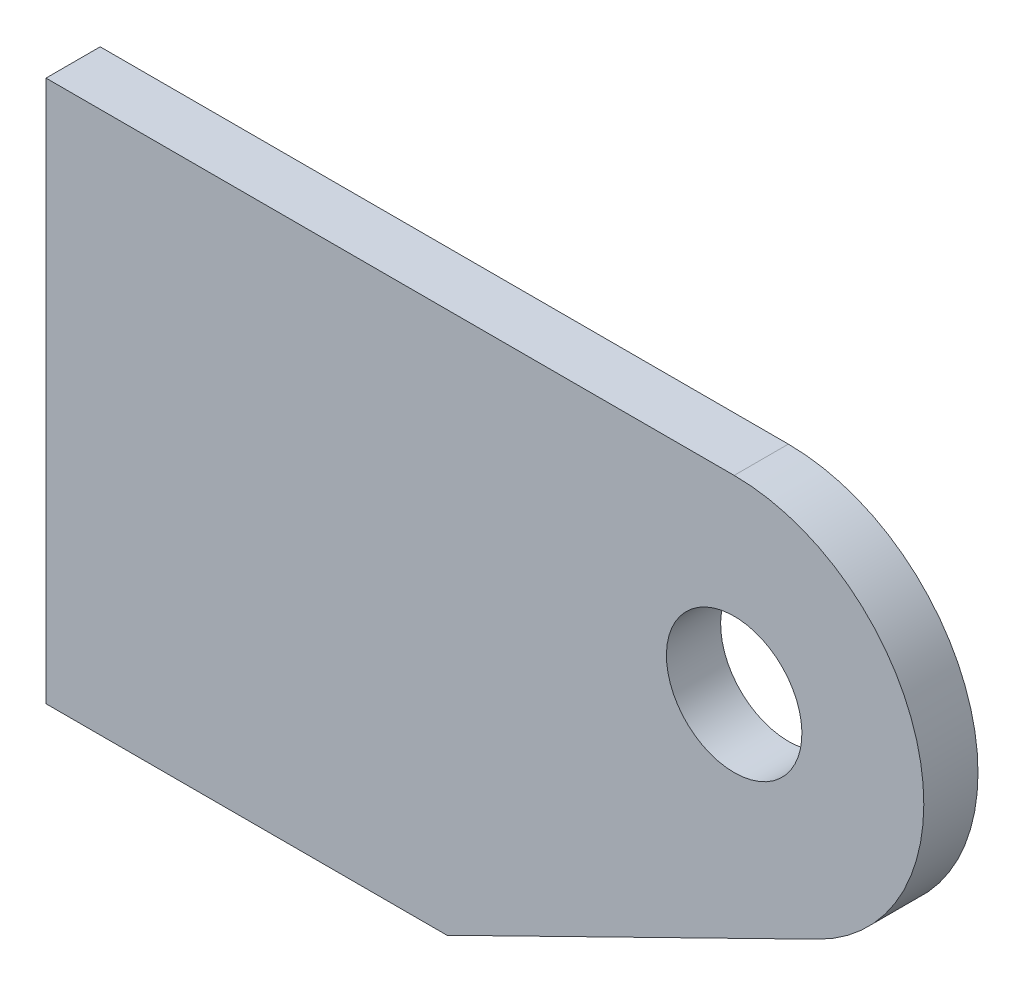
ISO-10303-21;
HEADER;
FILE_DESCRIPTION(('STEP AP214'),'2;1');
FILE_NAME('part.step','',(''),(''),'','','');
FILE_SCHEMA(('AUTOMOTIVE_DESIGN { 1 0 10303 214 1 1 1 1 }'));
ENDSEC;
DATA;
#1=APPLICATION_CONTEXT('core data for automotive mechanical design processes');
#2=APPLICATION_PROTOCOL_DEFINITION('international standard','automotive_design',2000,#1);
#3=PRODUCT_CONTEXT('',#1,'mechanical');
#4=PRODUCT('Part','Part','',(#3));
#5=PRODUCT_RELATED_PRODUCT_CATEGORY('part','',(#4));
#6=PRODUCT_DEFINITION_FORMATION('','',#4);
#7=PRODUCT_DEFINITION_CONTEXT('part definition',#1,'design');
#8=PRODUCT_DEFINITION('design','',#6,#7);
#9=PRODUCT_DEFINITION_SHAPE('','',#8);
#10=(LENGTH_UNIT() NAMED_UNIT(*) SI_UNIT(.MILLI.,.METRE.));
#11=(NAMED_UNIT(*) PLANE_ANGLE_UNIT() SI_UNIT($,.RADIAN.));
#12=(NAMED_UNIT(*) SI_UNIT($,.STERADIAN.) SOLID_ANGLE_UNIT());
#13=UNCERTAINTY_MEASURE_WITH_UNIT(LENGTH_MEASURE(1.E-05),#10,'distance_accuracy_value','');
#14=(GEOMETRIC_REPRESENTATION_CONTEXT(3) GLOBAL_UNCERTAINTY_ASSIGNED_CONTEXT((#13)) GLOBAL_UNIT_ASSIGNED_CONTEXT((#10,
#11,#12)) REPRESENTATION_CONTEXT('',''));
#15=CARTESIAN_POINT('',(0.,0.,0.));
#16=DIRECTION('',(0.,0.,1.));
#17=DIRECTION('',(1.,0.,0.));
#18=AXIS2_PLACEMENT_3D('',#15,#16,#17);
#19=CARTESIAN_POINT('',(-1622.48401946472,187.96,158.75));
#20=DIRECTION('',(0.,0.,-1.));
#21=DIRECTION('',(0.,1.,0.));
#22=AXIS2_PLACEMENT_3D('',#19,#20,#21);
#23=CYLINDRICAL_SURFACE('',#22,8.89000000000011);
#24=CARTESIAN_POINT('',(-1622.48401946472,187.96,156.21));
#25=DIRECTION('',(0.,0.,-1.));
#26=DIRECTION('',(0.,1.,0.));
#27=AXIS2_PLACEMENT_3D('',#24,#25,#26);
#28=CIRCLE('',#27,8.89000000000011);
#29=CARTESIAN_POINT('',(-1622.48401946472,196.85,156.21));
#30=VERTEX_POINT('',#29);
#31=CARTESIAN_POINT('',(-1618.56719751462,179.979360563764,156.21));
#32=VERTEX_POINT('',#31);
#33=EDGE_CURVE('E111',#30,#32,#28,.T.);
#34=ORIENTED_EDGE('',*,*,#33,.F.);
#35=DIRECTION('',(0.,0.,-1.));
#36=VECTOR('',#35,1.);
#37=CARTESIAN_POINT('',(-1622.48401946472,196.85,158.75));
#38=LINE('',#37,#36);
#39=CARTESIAN_POINT('',(-1622.48401946472,196.85,158.75));
#40=VERTEX_POINT('',#39);
#41=EDGE_CURVE('E11',#40,#30,#38,.T.);
#42=ORIENTED_EDGE('',*,*,#41,.F.);
#43=CARTESIAN_POINT('',(-1622.48401946472,187.96,158.75));
#44=DIRECTION('',(0.,0.,-1.));
#45=DIRECTION('',(0.,1.,0.));
#46=AXIS2_PLACEMENT_3D('',#43,#44,#45);
#47=CIRCLE('',#46,8.89000000000011);
#48=CARTESIAN_POINT('',(-1618.56719751462,179.979360563764,158.75));
#49=VERTEX_POINT('',#48);
#50=EDGE_CURVE('E106',#40,#49,#47,.T.);
#51=ORIENTED_EDGE('',*,*,#50,.T.);
#52=DIRECTION('',(0.,0.,-1.));
#53=VECTOR('',#52,1.);
#54=CARTESIAN_POINT('',(-1618.56719751462,179.979360563764,158.75));
#55=LINE('',#54,#53);
#56=EDGE_CURVE('E37',#49,#32,#55,.T.);
#57=ORIENTED_EDGE('',*,*,#56,.T.);
#58=EDGE_LOOP('',(#34,#42,#51,#57));
#59=FACE_BOUND('',#58,.T.);
#60=ADVANCED_FACE('F34',(#59),#23,.T.);
#61=CARTESIAN_POINT('',(-1654.74201946472,196.85,158.75));
#62=DIRECTION('',(0.,1.,0.));
#63=DIRECTION('',(-1.,0.,0.));
#64=AXIS2_PLACEMENT_3D('',#61,#62,#63);
#65=PLANE('',#64);
#66=DIRECTION('',(1.,0.,0.));
#67=VECTOR('',#66,1.);
#68=CARTESIAN_POINT('',(-1654.74201946472,196.85,156.21));
#69=LINE('',#68,#67);
#70=CARTESIAN_POINT('',(-1654.74201946472,196.85,156.21));
#71=VERTEX_POINT('',#70);
#72=EDGE_CURVE('E121',#71,#30,#69,.T.);
#73=ORIENTED_EDGE('',*,*,#72,.F.);
#74=DIRECTION('',(0.,0.,-1.));
#75=VECTOR('',#74,1.);
#76=CARTESIAN_POINT('',(-1654.74201946472,196.85,158.75));
#77=LINE('',#76,#75);
#78=CARTESIAN_POINT('',(-1654.74201946472,196.85,158.75));
#79=VERTEX_POINT('',#78);
#80=EDGE_CURVE('E43',#79,#71,#77,.T.);
#81=ORIENTED_EDGE('',*,*,#80,.F.);
#82=DIRECTION('',(1.,0.,0.));
#83=VECTOR('',#82,1.);
#84=CARTESIAN_POINT('',(-1654.74201946472,196.85,158.75));
#85=LINE('',#84,#83);
#86=EDGE_CURVE('E101',#79,#40,#85,.T.);
#87=ORIENTED_EDGE('',*,*,#86,.T.);
#88=ORIENTED_EDGE('',*,*,#41,.T.);
#89=EDGE_LOOP('',(#73,#81,#87,#88));
#90=FACE_BOUND('',#89,.T.);
#91=ADVANCED_FACE('F127',(#90),#65,.T.);
#92=CARTESIAN_POINT('',(-1654.74201946472,196.85,158.75));
#93=DIRECTION('',(-1.,0.,0.));
#94=DIRECTION('',(0.,0.,1.));
#95=AXIS2_PLACEMENT_3D('',#92,#93,#94);
#96=PLANE('',#95);
#97=DIRECTION('',(0.,1.,0.));
#98=VECTOR('',#97,1.);
#99=CARTESIAN_POINT('',(-1654.74201946472,196.85,156.21));
#100=LINE('',#99,#98);
#101=CARTESIAN_POINT('',(-1654.74201946472,171.45,156.21));
#102=VERTEX_POINT('',#101);
#103=EDGE_CURVE('E90',#102,#71,#100,.T.);
#104=ORIENTED_EDGE('',*,*,#103,.F.);
#105=DIRECTION('',(0.,0.,-1.));
#106=VECTOR('',#105,1.);
#107=CARTESIAN_POINT('',(-1654.74201946472,171.45,158.75));
#108=LINE('',#107,#106);
#109=CARTESIAN_POINT('',(-1654.74201946472,171.45,158.75));
#110=VERTEX_POINT('',#109);
#111=EDGE_CURVE('E85',#110,#102,#108,.T.);
#112=ORIENTED_EDGE('',*,*,#111,.F.);
#113=DIRECTION('',(0.,1.,0.));
#114=VECTOR('',#113,1.);
#115=CARTESIAN_POINT('',(-1654.74201946472,196.85,158.75));
#116=LINE('',#115,#114);
#117=EDGE_CURVE('E88',#110,#79,#116,.T.);
#118=ORIENTED_EDGE('',*,*,#117,.T.);
#119=ORIENTED_EDGE('',*,*,#80,.T.);
#120=EDGE_LOOP('',(#104,#112,#118,#119));
#121=FACE_BOUND('',#120,.T.);
#122=ADVANCED_FACE('F87',(#121),#96,.T.);
#123=CARTESIAN_POINT('',(-1654.74201946472,171.45,158.75));
#124=DIRECTION('',(0.,-1.,0.));
#125=DIRECTION('',(0.,0.,-1.));
#126=AXIS2_PLACEMENT_3D('',#123,#124,#125);
#127=PLANE('',#126);
#128=DIRECTION('',(-1.,0.,0.));
#129=VECTOR('',#128,1.);
#130=CARTESIAN_POINT('',(-1654.74201946472,171.45,156.21));
#131=LINE('',#130,#129);
#132=CARTESIAN_POINT('',(-1635.94601946472,171.45,156.21));
#133=VERTEX_POINT('',#132);
#134=EDGE_CURVE('E118',#133,#102,#131,.T.);
#135=ORIENTED_EDGE('',*,*,#134,.F.);
#136=DIRECTION('',(0.,0.,-1.));
#137=VECTOR('',#136,1.);
#138=CARTESIAN_POINT('',(-1635.94601946472,171.45,158.75));
#139=LINE('',#138,#137);
#140=CARTESIAN_POINT('',(-1635.94601946472,171.45,158.75));
#141=VERTEX_POINT('',#140);
#142=EDGE_CURVE('E95',#141,#133,#139,.T.);
#143=ORIENTED_EDGE('',*,*,#142,.F.);
#144=DIRECTION('',(-1.,0.,0.));
#145=VECTOR('',#144,1.);
#146=CARTESIAN_POINT('',(-1654.74201946472,171.45,158.75));
#147=LINE('',#146,#145);
#148=EDGE_CURVE('E100',#141,#110,#147,.T.);
#149=ORIENTED_EDGE('',*,*,#148,.T.);
#150=ORIENTED_EDGE('',*,*,#111,.T.);
#151=EDGE_LOOP('',(#135,#143,#149,#150));
#152=FACE_BOUND('',#151,.T.);
#153=ADVANCED_FACE('F103',(#152),#127,.T.);
#154=CARTESIAN_POINT('',(-1635.94601946472,171.45,158.75));
#155=DIRECTION('',(0.440587395961843,-0.897709722861217,0.));
#156=DIRECTION('',(0.897709722861217,0.440587395961843,0.));
#157=AXIS2_PLACEMENT_3D('',#154,#155,#156);
#158=PLANE('',#157);
#159=DIRECTION('',(-0.897709722861217,-0.440587395961843,0.));
#160=VECTOR('',#159,1.);
#161=CARTESIAN_POINT('',(-1635.94601946472,171.45,156.21));
#162=LINE('',#161,#160);
#163=EDGE_CURVE('E114',#32,#133,#162,.T.);
#164=ORIENTED_EDGE('',*,*,#163,.F.);
#165=ORIENTED_EDGE('',*,*,#56,.F.);
#166=DIRECTION('',(-0.897709722861217,-0.440587395961843,0.));
#167=VECTOR('',#166,1.);
#168=CARTESIAN_POINT('',(-1635.94601946472,171.45,158.75));
#169=LINE('',#168,#167);
#170=EDGE_CURVE('E104',#49,#141,#169,.T.);
#171=ORIENTED_EDGE('',*,*,#170,.T.);
#172=ORIENTED_EDGE('',*,*,#142,.T.);
#173=EDGE_LOOP('',(#164,#165,#171,#172));
#174=FACE_BOUND('',#173,.T.);
#175=ADVANCED_FACE('F124',(#174),#158,.T.);
#176=CARTESIAN_POINT('',(-1622.48401946472,187.96,158.75));
#177=DIRECTION('',(0.,0.,-1.));
#178=DIRECTION('',(0.,1.,0.));
#179=AXIS2_PLACEMENT_3D('',#176,#177,#178);
#180=PLANE('',#179);
#181=CARTESIAN_POINT('',(-1622.48401946472,187.96,158.75));
#182=DIRECTION('',(0.,0.,-1.));
#183=DIRECTION('',(0.,-1.,0.));
#184=AXIS2_PLACEMENT_3D('',#181,#182,#183);
#185=CIRCLE('',#184,3.17499999999986);
#186=CARTESIAN_POINT('',(-1622.48401946472,184.785,158.75));
#187=VERTEX_POINT('',#186);
#188=EDGE_CURVE('E115',#187,#187,#185,.T.);
#189=ORIENTED_EDGE('',*,*,#188,.T.);
#190=EDGE_LOOP('',(#189));
#191=FACE_BOUND('',#190,.T.);
#192=ORIENTED_EDGE('',*,*,#50,.F.);
#193=ORIENTED_EDGE('',*,*,#86,.F.);
#194=ORIENTED_EDGE('',*,*,#117,.F.);
#195=ORIENTED_EDGE('',*,*,#148,.F.);
#196=ORIENTED_EDGE('',*,*,#170,.F.);
#197=EDGE_LOOP('',(#192,#193,#194,#195,#196));
#198=FACE_BOUND('',#197,.T.);
#199=ADVANCED_FACE('F99',(#191,#198),#180,.F.);
#200=CARTESIAN_POINT('',(-1622.48401946472,187.96,156.21));
#201=DIRECTION('',(0.,0.,-1.));
#202=DIRECTION('',(0.,1.,0.));
#203=AXIS2_PLACEMENT_3D('',#200,#201,#202);
#204=PLANE('',#203);
#205=CARTESIAN_POINT('',(-1622.48401946472,187.96,156.21));
#206=DIRECTION('',(0.,0.,-1.));
#207=DIRECTION('',(0.,-1.,0.));
#208=AXIS2_PLACEMENT_3D('',#205,#206,#207);
#209=CIRCLE('',#208,3.17499999999986);
#210=CARTESIAN_POINT('',(-1622.48401946472,184.785,156.21));
#211=VERTEX_POINT('',#210);
#212=EDGE_CURVE('E159',#211,#211,#209,.T.);
#213=ORIENTED_EDGE('',*,*,#212,.F.);
#214=EDGE_LOOP('',(#213));
#215=FACE_BOUND('',#214,.T.);
#216=ORIENTED_EDGE('',*,*,#33,.T.);
#217=ORIENTED_EDGE('',*,*,#163,.T.);
#218=ORIENTED_EDGE('',*,*,#134,.T.);
#219=ORIENTED_EDGE('',*,*,#103,.T.);
#220=ORIENTED_EDGE('',*,*,#72,.T.);
#221=EDGE_LOOP('',(#216,#217,#218,#219,#220));
#222=FACE_BOUND('',#221,.T.);
#223=ADVANCED_FACE('F126',(#215,#222),#204,.T.);
#224=CARTESIAN_POINT('',(-1622.48401946472,187.96,158.75));
#225=DIRECTION('',(0.,0.,-1.));
#226=DIRECTION('',(0.,1.,0.));
#227=AXIS2_PLACEMENT_3D('',#224,#225,#226);
#228=CYLINDRICAL_SURFACE('',#227,3.17499999999986);
#229=ORIENTED_EDGE('',*,*,#188,.F.);
#230=EDGE_LOOP('',(#229));
#231=FACE_BOUND('',#230,.T.);
#232=ORIENTED_EDGE('',*,*,#212,.T.);
#233=EDGE_LOOP('',(#232));
#234=FACE_BOUND('',#233,.T.);
#235=ADVANCED_FACE('F147',(#231,#234),#228,.F.);
#236=CLOSED_SHELL('',(#60,#91,#122,#153,#175,#199,#223,#235));
#237=MANIFOLD_SOLID_BREP('B2',#236);
#238=ADVANCED_BREP_SHAPE_REPRESENTATION('',(#18,#237),#14);
#239=SHAPE_DEFINITION_REPRESENTATION(#9,#238);
ENDSEC;
END-ISO-10303-21;
